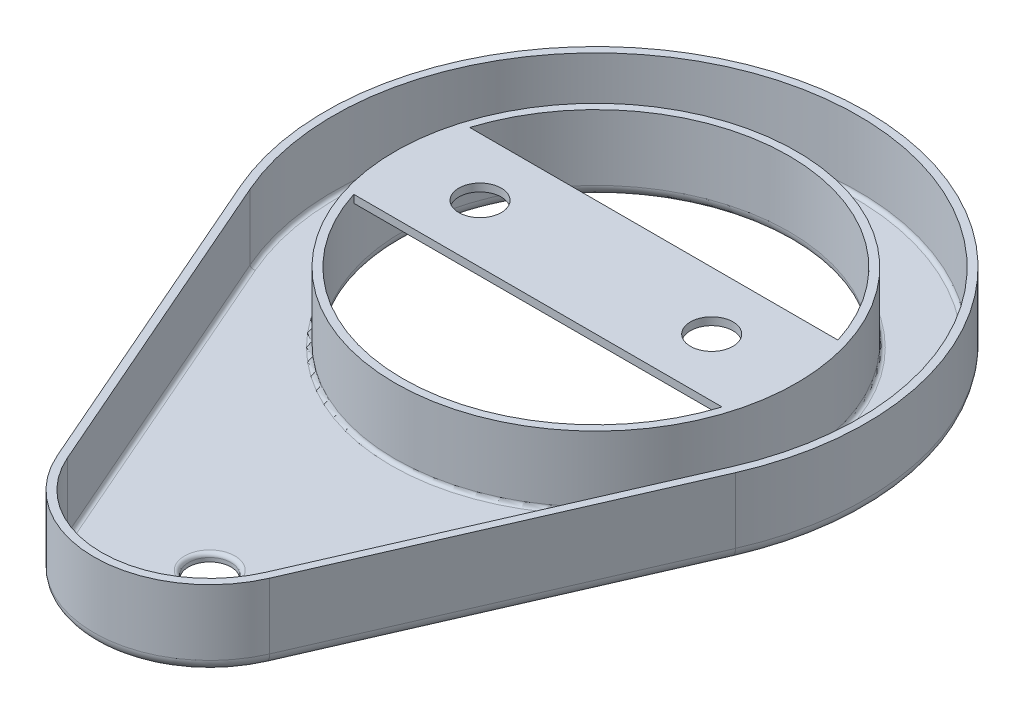
ISO-10303-21;
HEADER;
FILE_DESCRIPTION(('STEP AP214'),'2;1');
FILE_NAME('part.step','',(''),(''),'','','');
FILE_SCHEMA(('AUTOMOTIVE_DESIGN { 1 0 10303 214 1 1 1 1 }'));
ENDSEC;
DATA;
#1=APPLICATION_CONTEXT('core data for automotive mechanical design processes');
#2=APPLICATION_PROTOCOL_DEFINITION('international standard','automotive_design',2000,#1);
#3=PRODUCT_CONTEXT('',#1,'mechanical');
#4=PRODUCT('Part','Part','',(#3));
#5=PRODUCT_RELATED_PRODUCT_CATEGORY('part','',(#4));
#6=PRODUCT_DEFINITION_FORMATION('','',#4);
#7=PRODUCT_DEFINITION_CONTEXT('part definition',#1,'design');
#8=PRODUCT_DEFINITION('design','',#6,#7);
#9=PRODUCT_DEFINITION_SHAPE('','',#8);
#10=(LENGTH_UNIT() NAMED_UNIT(*) SI_UNIT(.MILLI.,.METRE.));
#11=(NAMED_UNIT(*) PLANE_ANGLE_UNIT() SI_UNIT($,.RADIAN.));
#12=(NAMED_UNIT(*) SI_UNIT($,.STERADIAN.) SOLID_ANGLE_UNIT());
#13=UNCERTAINTY_MEASURE_WITH_UNIT(LENGTH_MEASURE(1.E-05),#10,'distance_accuracy_value','');
#14=(GEOMETRIC_REPRESENTATION_CONTEXT(3) GLOBAL_UNCERTAINTY_ASSIGNED_CONTEXT((#13)) GLOBAL_UNIT_ASSIGNED_CONTEXT((#10,
#11,#12)) REPRESENTATION_CONTEXT('',''));
#15=CARTESIAN_POINT('',(0.,0.,0.));
#16=DIRECTION('',(0.,0.,1.));
#17=DIRECTION('',(1.,0.,0.));
#18=AXIS2_PLACEMENT_3D('',#15,#16,#17);
#19=CARTESIAN_POINT('',(0.,10.,0.));
#20=DIRECTION('',(0.,1.,0.));
#21=DIRECTION('',(0.,0.,1.));
#22=AXIS2_PLACEMENT_3D('',#19,#20,#21);
#23=PLANE('',#22);
#24=CARTESIAN_POINT('',(15.,10.,-50.));
#25=DIRECTION('',(0.,1.,0.));
#26=DIRECTION('',(0.,0.,1.));
#27=AXIS2_PLACEMENT_3D('',#24,#25,#26);
#28=CIRCLE('',#27,2.75);
#29=CARTESIAN_POINT('',(15.,10.,-47.25));
#30=VERTEX_POINT('',#29);
#31=EDGE_CURVE('E508',#30,#30,#28,.F.);
#32=ORIENTED_EDGE('',*,*,#31,.T.);
#33=EDGE_LOOP('',(#32));
#34=FACE_BOUND('',#33,.T.);
#35=CARTESIAN_POINT('',(-15.,10.,-50.));
#36=DIRECTION('',(0.,1.,0.));
#37=DIRECTION('',(0.,0.,1.));
#38=AXIS2_PLACEMENT_3D('',#35,#36,#37);
#39=CIRCLE('',#38,2.75);
#40=CARTESIAN_POINT('',(-15.,10.,-47.25));
#41=VERTEX_POINT('',#40);
#42=EDGE_CURVE('E517',#41,#41,#39,.F.);
#43=ORIENTED_EDGE('',*,*,#42,.T.);
#44=EDGE_LOOP('',(#43));
#45=FACE_BOUND('',#44,.T.);
#46=CARTESIAN_POINT('',(0.,10.,-50.));
#47=DIRECTION('',(0.,1.,0.));
#48=DIRECTION('',(0.,0.,1.));
#49=AXIS2_PLACEMENT_3D('',#46,#47,#48);
#50=CIRCLE('',#49,25.);
#51=CARTESIAN_POINT('',(23.8484800354236,10.,-57.5));
#52=VERTEX_POINT('',#51);
#53=CARTESIAN_POINT('',(-23.8484800354236,10.,-57.5));
#54=VERTEX_POINT('',#53);
#55=EDGE_CURVE('E156',#52,#54,#50,.T.);
#56=ORIENTED_EDGE('',*,*,#55,.F.);
#57=DIRECTION('',(-1.,0.,0.));
#58=VECTOR('',#57,1.);
#59=CARTESIAN_POINT('',(-23.8484800354236,10.,-57.5));
#60=LINE('',#59,#58);
#61=EDGE_CURVE('E172',#52,#54,#60,.T.);
#62=ORIENTED_EDGE('',*,*,#61,.T.);
#63=EDGE_LOOP('',(#56,#62));
#64=FACE_BOUND('',#63,.T.);
#65=DIRECTION('',(1.,0.,0.));
#66=VECTOR('',#65,1.);
#67=CARTESIAN_POINT('',(-23.8484800354236,10.,-42.5));
#68=LINE('',#67,#66);
#69=CARTESIAN_POINT('',(-23.8484800354236,10.,-42.5));
#70=VERTEX_POINT('',#69);
#71=CARTESIAN_POINT('',(23.8484800354236,10.,-42.5));
#72=VERTEX_POINT('',#71);
#73=EDGE_CURVE('E153',#70,#72,#68,.T.);
#74=ORIENTED_EDGE('',*,*,#73,.T.);
#75=EDGE_CURVE('E149',#70,#72,#50,.T.);
#76=ORIENTED_EDGE('',*,*,#75,.F.);
#77=EDGE_LOOP('',(#74,#76));
#78=FACE_BOUND('',#77,.T.);
#79=CARTESIAN_POINT('',(0.,10.,-50.));
#80=DIRECTION('',(0.,1.,0.));
#81=DIRECTION('',(0.,0.,1.));
#82=AXIS2_PLACEMENT_3D('',#79,#80,#81);
#83=CIRCLE('',#82,26.);
#84=CARTESIAN_POINT('',(0.,10.,-24.));
#85=VERTEX_POINT('',#84);
#86=EDGE_CURVE('E186',#85,#85,#83,.T.);
#87=ORIENTED_EDGE('',*,*,#86,.T.);
#88=EDGE_LOOP('',(#87));
#89=FACE_BOUND('',#88,.T.);
#90=ADVANCED_FACE('F34',(#34,#45,#64,#78,#89),#23,.T.);
#91=CARTESIAN_POINT('',(0.,10.,0.));
#92=DIRECTION('',(0.,1.,0.));
#93=DIRECTION('',(0.,0.,1.));
#94=AXIS2_PLACEMENT_3D('',#91,#92,#93);
#95=CIRCLE('',#94,14.);
#96=CARTESIAN_POINT('',(-12.8312119458764,10.,5.6));
#97=VERTEX_POINT('',#96);
#98=CARTESIAN_POINT('',(12.8312119458764,10.,5.6));
#99=VERTEX_POINT('',#98);
#100=EDGE_CURVE('E202',#97,#99,#95,.T.);
#101=ORIENTED_EDGE('',*,*,#100,.F.);
#102=DIRECTION('',(0.4,0.,0.916515138991168));
#103=VECTOR('',#102,1.);
#104=CARTESIAN_POINT('',(-12.8312119458764,10.,5.6));
#105=LINE('',#104,#103);
#106=CARTESIAN_POINT('',(-31.1615147256997,10.,-36.4));
#107=VERTEX_POINT('',#106);
#108=EDGE_CURVE('E197',#107,#97,#105,.T.);
#109=ORIENTED_EDGE('',*,*,#108,.F.);
#110=CARTESIAN_POINT('',(0.,10.,-50.));
#111=DIRECTION('',(0.,1.,0.));
#112=DIRECTION('',(0.,0.,1.));
#113=AXIS2_PLACEMENT_3D('',#110,#111,#112);
#114=CIRCLE('',#113,34.);
#115=CARTESIAN_POINT('',(31.1615147256997,10.,-36.4));
#116=VERTEX_POINT('',#115);
#117=EDGE_CURVE('E206',#116,#107,#114,.T.);
#118=ORIENTED_EDGE('',*,*,#117,.F.);
#119=DIRECTION('',(0.4,0.,-0.916515138991168));
#120=VECTOR('',#119,1.);
#121=CARTESIAN_POINT('',(12.8312119458764,10.,5.6));
#122=LINE('',#121,#120);
#123=EDGE_CURVE('E204',#99,#116,#122,.T.);
#124=ORIENTED_EDGE('',*,*,#123,.F.);
#125=EDGE_LOOP('',(#101,#109,#118,#124));
#126=FACE_BOUND('',#125,.T.);
#127=CARTESIAN_POINT('',(0.,10.,0.));
#128=DIRECTION('',(0.,1.,0.));
#129=DIRECTION('',(0.,0.,1.));
#130=AXIS2_PLACEMENT_3D('',#127,#128,#129);
#131=CIRCLE('',#130,15.);
#132=CARTESIAN_POINT('',(-13.7477270848675,10.,6.));
#133=VERTEX_POINT('',#132);
#134=CARTESIAN_POINT('',(13.7477270848675,10.,6.));
#135=VERTEX_POINT('',#134);
#136=EDGE_CURVE('E212',#133,#135,#131,.T.);
#137=ORIENTED_EDGE('',*,*,#136,.T.);
#138=DIRECTION('',(0.4,0.,-0.916515138991168));
#139=VECTOR('',#138,1.);
#140=CARTESIAN_POINT('',(13.7477270848675,10.,6.));
#141=LINE('',#140,#139);
#142=CARTESIAN_POINT('',(32.0780298646909,10.,-36.));
#143=VERTEX_POINT('',#142);
#144=EDGE_CURVE('E215',#135,#143,#141,.T.);
#145=ORIENTED_EDGE('',*,*,#144,.T.);
#146=CARTESIAN_POINT('',(0.,10.,-50.));
#147=DIRECTION('',(0.,1.,0.));
#148=DIRECTION('',(0.,0.,1.));
#149=AXIS2_PLACEMENT_3D('',#146,#147,#148);
#150=CIRCLE('',#149,35.);
#151=CARTESIAN_POINT('',(-32.0780298646909,10.,-36.));
#152=VERTEX_POINT('',#151);
#153=EDGE_CURVE('E217',#143,#152,#150,.T.);
#154=ORIENTED_EDGE('',*,*,#153,.T.);
#155=DIRECTION('',(0.4,0.,0.916515138991168));
#156=VECTOR('',#155,1.);
#157=CARTESIAN_POINT('',(-13.7477270848675,10.,6.));
#158=LINE('',#157,#156);
#159=EDGE_CURVE('E219',#152,#133,#158,.T.);
#160=ORIENTED_EDGE('',*,*,#159,.T.);
#161=EDGE_LOOP('',(#137,#145,#154,#160));
#162=FACE_BOUND('',#161,.T.);
#163=ADVANCED_FACE('F325',(#126,#162),#23,.T.);
#164=CARTESIAN_POINT('',(0.,0.,0.));
#165=DIRECTION('',(0.,1.,0.));
#166=DIRECTION('',(0.,0.,1.));
#167=AXIS2_PLACEMENT_3D('',#164,#165,#166);
#168=PLANE('',#167);
#169=CARTESIAN_POINT('',(0.,0.,-50.));
#170=DIRECTION('',(0.,1.,0.));
#171=DIRECTION('',(0.,0.,1.));
#172=AXIS2_PLACEMENT_3D('',#169,#170,#171);
#173=CIRCLE('',#172,26.5);
#174=CARTESIAN_POINT('',(0.,0.,-23.5));
#175=VERTEX_POINT('',#174);
#176=EDGE_CURVE('E281',#175,#175,#173,.T.);
#177=ORIENTED_EDGE('',*,*,#176,.T.);
#178=EDGE_LOOP('',(#177));
#179=FACE_BOUND('',#178,.T.);
#180=DIRECTION('',(0.4,0.,-0.916515138991168));
#181=VECTOR('',#180,1.);
#182=CARTESIAN_POINT('',(12.3729543763808,0.,5.4));
#183=LINE('',#182,#181);
#184=CARTESIAN_POINT('',(30.7032571562041,0.,-36.6));
#185=VERTEX_POINT('',#184);
#186=CARTESIAN_POINT('',(12.3729543763808,0.,5.4));
#187=VERTEX_POINT('',#186);
#188=EDGE_CURVE('E272',#185,#187,#183,.F.);
#189=ORIENTED_EDGE('',*,*,#188,.T.);
#190=CARTESIAN_POINT('',(0.,0.,0.));
#191=DIRECTION('',(0.,1.,0.));
#192=DIRECTION('',(0.,0.,1.));
#193=AXIS2_PLACEMENT_3D('',#190,#191,#192);
#194=CIRCLE('',#193,13.5);
#195=CARTESIAN_POINT('',(-12.3729543763808,0.,5.4));
#196=VERTEX_POINT('',#195);
#197=EDGE_CURVE('E278',#187,#196,#194,.F.);
#198=ORIENTED_EDGE('',*,*,#197,.T.);
#199=DIRECTION('',(0.4,0.,0.916515138991168));
#200=VECTOR('',#199,1.);
#201=CARTESIAN_POINT('',(-12.3729543763808,0.,5.4));
#202=LINE('',#201,#200);
#203=CARTESIAN_POINT('',(-30.7032571562041,0.,-36.6));
#204=VERTEX_POINT('',#203);
#205=EDGE_CURVE('E276',#196,#204,#202,.F.);
#206=ORIENTED_EDGE('',*,*,#205,.T.);
#207=CARTESIAN_POINT('',(0.,0.,-50.));
#208=DIRECTION('',(0.,1.,0.));
#209=DIRECTION('',(0.,0.,1.));
#210=AXIS2_PLACEMENT_3D('',#207,#208,#209);
#211=CIRCLE('',#210,33.5);
#212=EDGE_CURVE('E274',#204,#185,#211,.F.);
#213=ORIENTED_EDGE('',*,*,#212,.T.);
#214=EDGE_LOOP('',(#189,#198,#206,#213));
#215=FACE_BOUND('',#214,.T.);
#216=CARTESIAN_POINT('',(0.,0.,0.));
#217=DIRECTION('',(0.,1.,0.));
#218=DIRECTION('',(0.,0.,1.));
#219=AXIS2_PLACEMENT_3D('',#216,#217,#218);
#220=CIRCLE('',#219,2.75);
#221=CARTESIAN_POINT('',(0.,0.,2.75));
#222=VERTEX_POINT('',#221);
#223=EDGE_CURVE('E173',#222,#222,#220,.F.);
#224=ORIENTED_EDGE('',*,*,#223,.F.);
#225=EDGE_LOOP('',(#224));
#226=FACE_BOUND('',#225,.T.);
#227=ADVANCED_FACE('F309',(#179,#215,#226),#168,.F.);
#228=CARTESIAN_POINT('',(0.,10.,0.));
#229=DIRECTION('',(0.,-1.,0.));
#230=DIRECTION('',(0.,0.,-1.));
#231=AXIS2_PLACEMENT_3D('',#228,#229,#230);
#232=CYLINDRICAL_SURFACE('',#231,15.);
#233=DIRECTION('',(0.,-1.,0.));
#234=VECTOR('',#233,1.);
#235=CARTESIAN_POINT('',(-13.7477270848675,10.,6.));
#236=LINE('',#235,#234);
#237=CARTESIAN_POINT('',(-13.7477270848675,1.5,6.));
#238=VERTEX_POINT('',#237);
#239=EDGE_CURVE('E221',#133,#238,#236,.T.);
#240=ORIENTED_EDGE('',*,*,#239,.T.);
#241=CARTESIAN_POINT('',(0.,1.5,0.));
#242=DIRECTION('',(0.,1.,0.));
#243=DIRECTION('',(0.,0.,1.));
#244=AXIS2_PLACEMENT_3D('',#241,#242,#243);
#245=CIRCLE('',#244,15.);
#246=CARTESIAN_POINT('',(13.7477270848675,1.5,6.));
#247=VERTEX_POINT('',#246);
#248=EDGE_CURVE('E260',#238,#247,#245,.T.);
#249=ORIENTED_EDGE('',*,*,#248,.T.);
#250=DIRECTION('',(0.,-1.,0.));
#251=VECTOR('',#250,1.);
#252=CARTESIAN_POINT('',(13.7477270848675,10.,6.));
#253=LINE('',#252,#251);
#254=EDGE_CURVE('E228',#135,#247,#253,.T.);
#255=ORIENTED_EDGE('',*,*,#254,.F.);
#256=ORIENTED_EDGE('',*,*,#136,.F.);
#257=EDGE_LOOP('',(#240,#249,#255,#256));
#258=FACE_BOUND('',#257,.T.);
#259=ADVANCED_FACE('F319',(#258),#232,.T.);
#260=CARTESIAN_POINT('',(13.7477270848675,10.,6.));
#261=DIRECTION('',(-0.916515138991168,0.,-0.4));
#262=DIRECTION('',(-0.4,0.,0.916515138991168));
#263=AXIS2_PLACEMENT_3D('',#260,#261,#262);
#264=PLANE('',#263);
#265=ORIENTED_EDGE('',*,*,#254,.T.);
#266=DIRECTION('',(0.4,0.,-0.916515138991168));
#267=VECTOR('',#266,1.);
#268=CARTESIAN_POINT('',(13.7477270848675,1.5,6.));
#269=LINE('',#268,#267);
#270=CARTESIAN_POINT('',(32.0780298646909,1.5,-36.));
#271=VERTEX_POINT('',#270);
#272=EDGE_CURVE('E11',#247,#271,#269,.T.);
#273=ORIENTED_EDGE('',*,*,#272,.T.);
#274=DIRECTION('',(0.,-1.,0.));
#275=VECTOR('',#274,1.);
#276=CARTESIAN_POINT('',(32.0780298646909,10.,-36.));
#277=LINE('',#276,#275);
#278=EDGE_CURVE('E226',#143,#271,#277,.T.);
#279=ORIENTED_EDGE('',*,*,#278,.F.);
#280=ORIENTED_EDGE('',*,*,#144,.F.);
#281=EDGE_LOOP('',(#265,#273,#279,#280));
#282=FACE_BOUND('',#281,.T.);
#283=ADVANCED_FACE('F322',(#282),#264,.F.);
#284=CARTESIAN_POINT('',(0.,10.,-50.));
#285=DIRECTION('',(0.,-1.,0.));
#286=DIRECTION('',(0.,0.,-1.));
#287=AXIS2_PLACEMENT_3D('',#284,#285,#286);
#288=CYLINDRICAL_SURFACE('',#287,35.);
#289=ORIENTED_EDGE('',*,*,#278,.T.);
#290=CARTESIAN_POINT('',(0.,1.5,-50.));
#291=DIRECTION('',(0.,1.,0.));
#292=DIRECTION('',(0.,0.,1.));
#293=AXIS2_PLACEMENT_3D('',#290,#291,#292);
#294=CIRCLE('',#293,35.);
#295=CARTESIAN_POINT('',(-32.0780298646909,1.5,-36.));
#296=VERTEX_POINT('',#295);
#297=EDGE_CURVE('E56',#271,#296,#294,.T.);
#298=ORIENTED_EDGE('',*,*,#297,.T.);
#299=DIRECTION('',(0.,-1.,0.));
#300=VECTOR('',#299,1.);
#301=CARTESIAN_POINT('',(-32.0780298646909,10.,-36.));
#302=LINE('',#301,#300);
#303=EDGE_CURVE('E224',#152,#296,#302,.T.);
#304=ORIENTED_EDGE('',*,*,#303,.F.);
#305=ORIENTED_EDGE('',*,*,#153,.F.);
#306=EDGE_LOOP('',(#289,#298,#304,#305));
#307=FACE_BOUND('',#306,.T.);
#308=ADVANCED_FACE('F329',(#307),#288,.T.);
#309=CARTESIAN_POINT('',(-13.7477270848675,10.,6.));
#310=DIRECTION('',(0.916515138991168,0.,-0.4));
#311=DIRECTION('',(-0.4,0.,-0.916515138991168));
#312=AXIS2_PLACEMENT_3D('',#309,#310,#311);
#313=PLANE('',#312);
#314=ORIENTED_EDGE('',*,*,#303,.T.);
#315=DIRECTION('',(0.4,0.,0.916515138991168));
#316=VECTOR('',#315,1.);
#317=CARTESIAN_POINT('',(-13.7477270848675,1.5,6.));
#318=LINE('',#317,#316);
#319=EDGE_CURVE('E284',#296,#238,#318,.T.);
#320=ORIENTED_EDGE('',*,*,#319,.T.);
#321=ORIENTED_EDGE('',*,*,#239,.F.);
#322=ORIENTED_EDGE('',*,*,#159,.F.);
#323=EDGE_LOOP('',(#314,#320,#321,#322));
#324=FACE_BOUND('',#323,.T.);
#325=ADVANCED_FACE('F328',(#324),#313,.F.);
#326=CARTESIAN_POINT('',(0.,10.,-50.));
#327=DIRECTION('',(0.,-1.,0.));
#328=DIRECTION('',(0.,0.,-1.));
#329=AXIS2_PLACEMENT_3D('',#326,#327,#328);
#330=CYLINDRICAL_SURFACE('',#329,25.);
#331=CARTESIAN_POINT('',(0.,1.5,-50.));
#332=DIRECTION('',(0.,1.,0.));
#333=DIRECTION('',(0.,0.,1.));
#334=AXIS2_PLACEMENT_3D('',#331,#332,#333);
#335=CIRCLE('',#334,25.);
#336=CARTESIAN_POINT('',(0.,1.5,-25.));
#337=VERTEX_POINT('',#336);
#338=EDGE_CURVE('E43',#337,#337,#335,.F.);
#339=ORIENTED_EDGE('',*,*,#338,.T.);
#340=EDGE_LOOP('',(#339));
#341=FACE_BOUND('',#340,.T.);
#342=DIRECTION('',(0.,1.,0.));
#343=VECTOR('',#342,1.);
#344=CARTESIAN_POINT('',(23.8484800354236,9.,-57.5));
#345=LINE('',#344,#343);
#346=CARTESIAN_POINT('',(23.8484800354236,9.,-57.5));
#347=VERTEX_POINT('',#346);
#348=EDGE_CURVE('E187',#347,#52,#345,.T.);
#349=ORIENTED_EDGE('',*,*,#348,.T.);
#350=ORIENTED_EDGE('',*,*,#55,.T.);
#351=DIRECTION('',(0.,1.,0.));
#352=VECTOR('',#351,1.);
#353=CARTESIAN_POINT('',(-23.8484800354236,9.,-57.5));
#354=LINE('',#353,#352);
#355=CARTESIAN_POINT('',(-23.8484800354236,9.,-57.5));
#356=VERTEX_POINT('',#355);
#357=EDGE_CURVE('E183',#356,#54,#354,.T.);
#358=ORIENTED_EDGE('',*,*,#357,.F.);
#359=CARTESIAN_POINT('',(0.,9.,-50.));
#360=DIRECTION('',(0.,1.,0.));
#361=DIRECTION('',(0.,0.,1.));
#362=AXIS2_PLACEMENT_3D('',#359,#360,#361);
#363=CIRCLE('',#362,25.);
#364=CARTESIAN_POINT('',(-23.8484800354236,9.,-42.5));
#365=VERTEX_POINT('',#364);
#366=EDGE_CURVE('E164',#356,#365,#363,.T.);
#367=ORIENTED_EDGE('',*,*,#366,.T.);
#368=DIRECTION('',(0.,1.,0.));
#369=VECTOR('',#368,1.);
#370=CARTESIAN_POINT('',(-23.8484800354236,9.,-42.5));
#371=LINE('',#370,#369);
#372=EDGE_CURVE('E160',#365,#70,#371,.T.);
#373=ORIENTED_EDGE('',*,*,#372,.T.);
#374=ORIENTED_EDGE('',*,*,#75,.T.);
#375=DIRECTION('',(0.,1.,0.));
#376=VECTOR('',#375,1.);
#377=CARTESIAN_POINT('',(23.8484800354236,9.,-42.5));
#378=LINE('',#377,#376);
#379=CARTESIAN_POINT('',(23.8484800354236,9.,-42.5));
#380=VERTEX_POINT('',#379);
#381=EDGE_CURVE('E168',#380,#72,#378,.T.);
#382=ORIENTED_EDGE('',*,*,#381,.F.);
#383=CARTESIAN_POINT('',(0.,9.,-50.));
#384=DIRECTION('',(0.,1.,0.));
#385=DIRECTION('',(0.,0.,1.));
#386=AXIS2_PLACEMENT_3D('',#383,#384,#385);
#387=CIRCLE('',#386,25.);
#388=EDGE_CURVE('E522',#380,#347,#387,.T.);
#389=ORIENTED_EDGE('',*,*,#388,.T.);
#390=EDGE_LOOP('',(#349,#350,#358,#367,#373,#374,#382,#389));
#391=FACE_BOUND('',#390,.T.);
#392=ADVANCED_FACE('F162',(#341,#391),#330,.F.);
#393=CARTESIAN_POINT('',(0.,1.,0.));
#394=DIRECTION('',(0.,1.,0.));
#395=DIRECTION('',(0.,0.,1.));
#396=AXIS2_PLACEMENT_3D('',#393,#394,#395);
#397=PLANE('',#396);
#398=CARTESIAN_POINT('',(0.,1.,-50.));
#399=DIRECTION('',(0.,1.,0.));
#400=DIRECTION('',(0.,0.,1.));
#401=AXIS2_PLACEMENT_3D('',#398,#399,#400);
#402=CIRCLE('',#401,26.5);
#403=CARTESIAN_POINT('',(0.,1.,-23.5));
#404=VERTEX_POINT('',#403);
#405=EDGE_CURVE('E245',#404,#404,#402,.F.);
#406=ORIENTED_EDGE('',*,*,#405,.T.);
#407=EDGE_LOOP('',(#406));
#408=FACE_BOUND('',#407,.T.);
#409=CARTESIAN_POINT('',(0.,1.,-50.));
#410=DIRECTION('',(0.,1.,0.));
#411=DIRECTION('',(0.,0.,1.));
#412=AXIS2_PLACEMENT_3D('',#409,#410,#411);
#413=CIRCLE('',#412,33.5);
#414=CARTESIAN_POINT('',(30.7032571562041,1.,-36.6));
#415=VERTEX_POINT('',#414);
#416=CARTESIAN_POINT('',(-30.7032571562041,1.,-36.6));
#417=VERTEX_POINT('',#416);
#418=EDGE_CURVE('E240',#415,#417,#413,.T.);
#419=ORIENTED_EDGE('',*,*,#418,.T.);
#420=DIRECTION('',(0.4,0.,0.916515138991168));
#421=VECTOR('',#420,1.);
#422=CARTESIAN_POINT('',(-12.3729543763808,1.,5.40000000000001));
#423=LINE('',#422,#421);
#424=CARTESIAN_POINT('',(-12.3729543763808,1.,5.40000000000001));
#425=VERTEX_POINT('',#424);
#426=EDGE_CURVE('E242',#417,#425,#423,.T.);
#427=ORIENTED_EDGE('',*,*,#426,.T.);
#428=CARTESIAN_POINT('',(0.,1.,0.));
#429=DIRECTION('',(0.,1.,0.));
#430=DIRECTION('',(0.,0.,1.));
#431=AXIS2_PLACEMENT_3D('',#428,#429,#430);
#432=CIRCLE('',#431,13.5);
#433=CARTESIAN_POINT('',(12.3729543763808,1.,5.4));
#434=VERTEX_POINT('',#433);
#435=EDGE_CURVE('E236',#425,#434,#432,.T.);
#436=ORIENTED_EDGE('',*,*,#435,.T.);
#437=DIRECTION('',(0.4,0.,-0.916515138991168));
#438=VECTOR('',#437,1.);
#439=CARTESIAN_POINT('',(30.7032571562041,1.,-36.6));
#440=LINE('',#439,#438);
#441=EDGE_CURVE('E238',#434,#415,#440,.T.);
#442=ORIENTED_EDGE('',*,*,#441,.T.);
#443=EDGE_LOOP('',(#419,#427,#436,#442));
#444=FACE_BOUND('',#443,.T.);
#445=CARTESIAN_POINT('',(0.,1.,0.));
#446=DIRECTION('',(0.,1.,0.));
#447=DIRECTION('',(0.,0.,1.));
#448=AXIS2_PLACEMENT_3D('',#445,#446,#447);
#449=CIRCLE('',#448,3.25);
#450=CARTESIAN_POINT('',(0.,1.,3.25));
#451=VERTEX_POINT('',#450);
#452=EDGE_CURVE('E233',#451,#451,#449,.F.);
#453=ORIENTED_EDGE('',*,*,#452,.T.);
#454=EDGE_LOOP('',(#453));
#455=FACE_BOUND('',#454,.T.);
#456=ADVANCED_FACE('F372',(#408,#444,#455),#397,.T.);
#457=CARTESIAN_POINT('',(0.,10.,0.));
#458=DIRECTION('',(0.,-1.,0.));
#459=DIRECTION('',(0.,0.,-1.));
#460=AXIS2_PLACEMENT_3D('',#457,#458,#459);
#461=CYLINDRICAL_SURFACE('',#460,14.);
#462=DIRECTION('',(0.,1.,0.));
#463=VECTOR('',#462,1.);
#464=CARTESIAN_POINT('',(12.8312119458764,10.,5.6));
#465=LINE('',#464,#463);
#466=CARTESIAN_POINT('',(12.8312119458764,1.5,5.6));
#467=VERTEX_POINT('',#466);
#468=EDGE_CURVE('E157',#99,#467,#465,.F.);
#469=ORIENTED_EDGE('',*,*,#468,.T.);
#470=CARTESIAN_POINT('',(0.,1.5,0.));
#471=DIRECTION('',(0.,1.,0.));
#472=DIRECTION('',(0.,0.,1.));
#473=AXIS2_PLACEMENT_3D('',#470,#471,#472);
#474=CIRCLE('',#473,14.);
#475=CARTESIAN_POINT('',(-12.8312119458763,1.5,5.60000000000001));
#476=VERTEX_POINT('',#475);
#477=EDGE_CURVE('E255',#467,#476,#474,.F.);
#478=ORIENTED_EDGE('',*,*,#477,.T.);
#479=DIRECTION('',(0.,-1.,0.));
#480=VECTOR('',#479,1.);
#481=CARTESIAN_POINT('',(-12.8312119458763,10.,5.60000000000001));
#482=LINE('',#481,#480);
#483=EDGE_CURVE('E193',#97,#476,#482,.T.);
#484=ORIENTED_EDGE('',*,*,#483,.F.);
#485=ORIENTED_EDGE('',*,*,#100,.T.);
#486=EDGE_LOOP('',(#469,#478,#484,#485));
#487=FACE_BOUND('',#486,.T.);
#488=ADVANCED_FACE('F376',(#487),#461,.F.);
#489=CARTESIAN_POINT('',(12.8312119458764,10.,5.6));
#490=DIRECTION('',(-0.916515138991168,0.,-0.4));
#491=DIRECTION('',(-0.4,0.,0.916515138991168));
#492=AXIS2_PLACEMENT_3D('',#489,#490,#491);
#493=PLANE('',#492);
#494=DIRECTION('',(0.,-1.,0.));
#495=VECTOR('',#494,1.);
#496=CARTESIAN_POINT('',(31.1615147256997,10.,-36.4));
#497=LINE('',#496,#495);
#498=CARTESIAN_POINT('',(31.1615147256997,1.5,-36.4));
#499=VERTEX_POINT('',#498);
#500=EDGE_CURVE('E192',#116,#499,#497,.T.);
#501=ORIENTED_EDGE('',*,*,#500,.T.);
#502=DIRECTION('',(0.4,0.,-0.916515138991168));
#503=VECTOR('',#502,1.);
#504=CARTESIAN_POINT('',(12.8312119458764,1.5,5.6));
#505=LINE('',#504,#503);
#506=EDGE_CURVE('E253',#499,#467,#505,.F.);
#507=ORIENTED_EDGE('',*,*,#506,.T.);
#508=ORIENTED_EDGE('',*,*,#468,.F.);
#509=ORIENTED_EDGE('',*,*,#123,.T.);
#510=EDGE_LOOP('',(#501,#507,#508,#509));
#511=FACE_BOUND('',#510,.T.);
#512=ADVANCED_FACE('F382',(#511),#493,.T.);
#513=CARTESIAN_POINT('',(0.,10.,-50.));
#514=DIRECTION('',(0.,-1.,0.));
#515=DIRECTION('',(0.,0.,-1.));
#516=AXIS2_PLACEMENT_3D('',#513,#514,#515);
#517=CYLINDRICAL_SURFACE('',#516,34.);
#518=DIRECTION('',(0.,1.,0.));
#519=VECTOR('',#518,1.);
#520=CARTESIAN_POINT('',(-31.1615147256997,10.,-36.4));
#521=LINE('',#520,#519);
#522=CARTESIAN_POINT('',(-31.1615147256997,1.5,-36.4));
#523=VERTEX_POINT('',#522);
#524=EDGE_CURVE('E196',#107,#523,#521,.F.);
#525=ORIENTED_EDGE('',*,*,#524,.T.);
#526=CARTESIAN_POINT('',(0.,1.5,-50.));
#527=DIRECTION('',(0.,1.,0.));
#528=DIRECTION('',(0.,0.,1.));
#529=AXIS2_PLACEMENT_3D('',#526,#527,#528);
#530=CIRCLE('',#529,34.);
#531=EDGE_CURVE('E251',#523,#499,#530,.F.);
#532=ORIENTED_EDGE('',*,*,#531,.T.);
#533=ORIENTED_EDGE('',*,*,#500,.F.);
#534=ORIENTED_EDGE('',*,*,#117,.T.);
#535=EDGE_LOOP('',(#525,#532,#533,#534));
#536=FACE_BOUND('',#535,.T.);
#537=ADVANCED_FACE('F391',(#536),#517,.F.);
#538=CARTESIAN_POINT('',(-12.8312119458764,10.,5.6));
#539=DIRECTION('',(0.916515138991168,0.,-0.4));
#540=DIRECTION('',(-0.4,0.,-0.916515138991168));
#541=AXIS2_PLACEMENT_3D('',#538,#539,#540);
#542=PLANE('',#541);
#543=ORIENTED_EDGE('',*,*,#483,.T.);
#544=DIRECTION('',(0.4,0.,0.916515138991168));
#545=VECTOR('',#544,1.);
#546=CARTESIAN_POINT('',(-31.1615147256997,1.5,-36.4));
#547=LINE('',#546,#545);
#548=EDGE_CURVE('E248',#476,#523,#547,.F.);
#549=ORIENTED_EDGE('',*,*,#548,.T.);
#550=ORIENTED_EDGE('',*,*,#524,.F.);
#551=ORIENTED_EDGE('',*,*,#108,.T.);
#552=EDGE_LOOP('',(#543,#549,#550,#551));
#553=FACE_BOUND('',#552,.T.);
#554=ADVANCED_FACE('F395',(#553),#542,.T.);
#555=CARTESIAN_POINT('',(0.,10.,-50.));
#556=DIRECTION('',(0.,-1.,0.));
#557=DIRECTION('',(0.,0.,-1.));
#558=AXIS2_PLACEMENT_3D('',#555,#556,#557);
#559=CYLINDRICAL_SURFACE('',#558,26.);
#560=CARTESIAN_POINT('',(0.,1.5,-50.));
#561=DIRECTION('',(0.,1.,0.));
#562=DIRECTION('',(0.,0.,1.));
#563=AXIS2_PLACEMENT_3D('',#560,#561,#562);
#564=CIRCLE('',#563,26.);
#565=CARTESIAN_POINT('',(0.,1.5,-24.));
#566=VERTEX_POINT('',#565);
#567=EDGE_CURVE('E230',#566,#566,#564,.T.);
#568=ORIENTED_EDGE('',*,*,#567,.T.);
#569=EDGE_LOOP('',(#568));
#570=FACE_BOUND('',#569,.T.);
#571=ORIENTED_EDGE('',*,*,#86,.F.);
#572=EDGE_LOOP('',(#571));
#573=FACE_BOUND('',#572,.T.);
#574=ADVANCED_FACE('F398',(#570,#573),#559,.T.);
#575=CARTESIAN_POINT('',(-23.8484800354236,9.,-57.5));
#576=DIRECTION('',(0.,0.,-1.));
#577=DIRECTION('',(-1.,0.,0.));
#578=AXIS2_PLACEMENT_3D('',#575,#576,#577);
#579=PLANE('',#578);
#580=ORIENTED_EDGE('',*,*,#61,.F.);
#581=ORIENTED_EDGE('',*,*,#348,.F.);
#582=DIRECTION('',(-1.,0.,0.));
#583=VECTOR('',#582,1.);
#584=CARTESIAN_POINT('',(-23.8484800354236,9.,-57.5));
#585=LINE('',#584,#583);
#586=EDGE_CURVE('E169',#347,#356,#585,.T.);
#587=ORIENTED_EDGE('',*,*,#586,.T.);
#588=ORIENTED_EDGE('',*,*,#357,.T.);
#589=EDGE_LOOP('',(#580,#581,#587,#588));
#590=FACE_BOUND('',#589,.T.);
#591=ADVANCED_FACE('F401',(#590),#579,.T.);
#592=CARTESIAN_POINT('',(-23.8484800354236,9.,-42.5));
#593=DIRECTION('',(0.,0.,1.));
#594=DIRECTION('',(1.,0.,0.));
#595=AXIS2_PLACEMENT_3D('',#592,#593,#594);
#596=PLANE('',#595);
#597=ORIENTED_EDGE('',*,*,#73,.F.);
#598=ORIENTED_EDGE('',*,*,#372,.F.);
#599=DIRECTION('',(1.,0.,0.));
#600=VECTOR('',#599,1.);
#601=CARTESIAN_POINT('',(-23.8484800354236,9.,-42.5));
#602=LINE('',#601,#600);
#603=EDGE_CURVE('E521',#365,#380,#602,.T.);
#604=ORIENTED_EDGE('',*,*,#603,.T.);
#605=ORIENTED_EDGE('',*,*,#381,.T.);
#606=EDGE_LOOP('',(#597,#598,#604,#605));
#607=FACE_BOUND('',#606,.T.);
#608=ADVANCED_FACE('F171',(#607),#596,.T.);
#609=CARTESIAN_POINT('',(0.,9.,-50.));
#610=DIRECTION('',(0.,1.,0.));
#611=DIRECTION('',(0.,0.,1.));
#612=AXIS2_PLACEMENT_3D('',#609,#610,#611);
#613=PLANE('',#612);
#614=CARTESIAN_POINT('',(15.,9.,-50.));
#615=DIRECTION('',(0.,-1.,0.));
#616=DIRECTION('',(0.,0.,-1.));
#617=AXIS2_PLACEMENT_3D('',#614,#615,#616);
#618=CIRCLE('',#617,2.75);
#619=CARTESIAN_POINT('',(15.,9.,-52.75));
#620=VERTEX_POINT('',#619);
#621=EDGE_CURVE('E292',#620,#620,#618,.T.);
#622=ORIENTED_EDGE('',*,*,#621,.F.);
#623=EDGE_LOOP('',(#622));
#624=FACE_BOUND('',#623,.T.);
#625=CARTESIAN_POINT('',(-15.,9.,-50.));
#626=DIRECTION('',(0.,-1.,0.));
#627=DIRECTION('',(0.,0.,1.));
#628=AXIS2_PLACEMENT_3D('',#625,#626,#627);
#629=CIRCLE('',#628,2.75);
#630=CARTESIAN_POINT('',(-15.,9.,-47.25));
#631=VERTEX_POINT('',#630);
#632=EDGE_CURVE('E512',#631,#631,#629,.T.);
#633=ORIENTED_EDGE('',*,*,#632,.F.);
#634=EDGE_LOOP('',(#633));
#635=FACE_BOUND('',#634,.T.);
#636=ORIENTED_EDGE('',*,*,#366,.F.);
#637=ORIENTED_EDGE('',*,*,#586,.F.);
#638=ORIENTED_EDGE('',*,*,#388,.F.);
#639=ORIENTED_EDGE('',*,*,#603,.F.);
#640=EDGE_LOOP('',(#636,#637,#638,#639));
#641=FACE_BOUND('',#640,.T.);
#642=ADVANCED_FACE('F424',(#624,#635,#641),#613,.F.);
#643=CARTESIAN_POINT('',(0.,-0.000999999999999916,0.));
#644=DIRECTION('',(0.,1.,0.));
#645=DIRECTION('',(0.,0.,1.));
#646=AXIS2_PLACEMENT_3D('',#643,#644,#645);
#647=CYLINDRICAL_SURFACE('',#646,2.75);
#648=CARTESIAN_POINT('',(0.,0.5,0.));
#649=DIRECTION('',(0.,1.,0.));
#650=DIRECTION('',(0.,0.,1.));
#651=AXIS2_PLACEMENT_3D('',#648,#649,#650);
#652=CIRCLE('',#651,2.75);
#653=CARTESIAN_POINT('',(0.,0.5,2.75));
#654=VERTEX_POINT('',#653);
#655=EDGE_CURVE('E257',#654,#654,#652,.T.);
#656=ORIENTED_EDGE('',*,*,#655,.T.);
#657=EDGE_LOOP('',(#656));
#658=FACE_BOUND('',#657,.T.);
#659=ORIENTED_EDGE('',*,*,#223,.T.);
#660=EDGE_LOOP('',(#659));
#661=FACE_BOUND('',#660,.T.);
#662=ADVANCED_FACE('F414',(#658,#661),#647,.F.);
#663=CARTESIAN_POINT('',(0.,1.5,-50.));
#664=DIRECTION('',(0.,1.,0.));
#665=DIRECTION('',(0.,0.,1.));
#666=AXIS2_PLACEMENT_3D('',#663,#664,#665);
#667=TOROIDAL_SURFACE('',#666,26.5,0.5);
#668=ORIENTED_EDGE('',*,*,#405,.F.);
#669=EDGE_LOOP('',(#668));
#670=FACE_BOUND('',#669,.T.);
#671=ORIENTED_EDGE('',*,*,#567,.F.);
#672=EDGE_LOOP('',(#671));
#673=FACE_BOUND('',#672,.T.);
#674=ADVANCED_FACE('F411',(#670,#673),#667,.F.);
#675=CARTESIAN_POINT('',(12.3729543763808,1.5,5.4));
#676=DIRECTION('',(-0.4,0.,0.916515138991168));
#677=DIRECTION('',(0.916515138991168,0.,0.4));
#678=AXIS2_PLACEMENT_3D('',#675,#676,#677);
#679=CYLINDRICAL_SURFACE('',#678,0.5);
#680=CARTESIAN_POINT('',(12.3729543763808,1.5,5.4));
#681=DIRECTION('',(0.399999999999999,0.,-0.916515138991168));
#682=DIRECTION('',(-0.916515138991168,0.,-0.399999999999999));
#683=AXIS2_PLACEMENT_3D('',#680,#681,#682);
#684=CIRCLE('',#683,0.5);
#685=EDGE_CURVE('E265',#467,#434,#684,.T.);
#686=ORIENTED_EDGE('',*,*,#685,.F.);
#687=ORIENTED_EDGE('',*,*,#506,.F.);
#688=CARTESIAN_POINT('',(30.7032571562041,1.5,-36.6));
#689=DIRECTION('',(-0.399999999999994,0.,0.916515138991171));
#690=DIRECTION('',(0.916515138991171,0.,0.399999999999994));
#691=AXIS2_PLACEMENT_3D('',#688,#689,#690);
#692=CIRCLE('',#691,0.5);
#693=EDGE_CURVE('E178',#415,#499,#692,.T.);
#694=ORIENTED_EDGE('',*,*,#693,.F.);
#695=ORIENTED_EDGE('',*,*,#441,.F.);
#696=EDGE_LOOP('',(#686,#687,#694,#695));
#697=FACE_BOUND('',#696,.T.);
#698=ADVANCED_FACE('F413',(#697),#679,.F.);
#699=CARTESIAN_POINT('',(0.,1.5,-50.));
#700=DIRECTION('',(0.,1.,0.));
#701=DIRECTION('',(0.,0.,1.));
#702=AXIS2_PLACEMENT_3D('',#699,#700,#701);
#703=TOROIDAL_SURFACE('',#702,33.5,0.5);
#704=ORIENTED_EDGE('',*,*,#693,.T.);
#705=ORIENTED_EDGE('',*,*,#531,.F.);
#706=CARTESIAN_POINT('',(-30.7032571562041,1.5,-36.6));
#707=DIRECTION('',(-0.399999999999996,0.,-0.91651513899117));
#708=DIRECTION('',(-0.91651513899117,0.,0.399999999999996));
#709=AXIS2_PLACEMENT_3D('',#706,#707,#708);
#710=CIRCLE('',#709,0.5);
#711=EDGE_CURVE('E263',#417,#523,#710,.T.);
#712=ORIENTED_EDGE('',*,*,#711,.F.);
#713=ORIENTED_EDGE('',*,*,#418,.F.);
#714=EDGE_LOOP('',(#704,#705,#712,#713));
#715=FACE_BOUND('',#714,.T.);
#716=ADVANCED_FACE('F421',(#715),#703,.F.);
#717=CARTESIAN_POINT('',(0.,1.5,0.));
#718=DIRECTION('',(0.,1.,0.));
#719=DIRECTION('',(0.,0.,1.));
#720=AXIS2_PLACEMENT_3D('',#717,#718,#719);
#721=TOROIDAL_SURFACE('',#720,13.5,0.5);
#722=ORIENTED_EDGE('',*,*,#685,.T.);
#723=ORIENTED_EDGE('',*,*,#435,.F.);
#724=CARTESIAN_POINT('',(-12.3729543763808,1.5,5.40000000000001));
#725=DIRECTION('',(0.4,0.,0.916515138991168));
#726=DIRECTION('',(0.916515138991168,0.,-0.400000000000001));
#727=AXIS2_PLACEMENT_3D('',#724,#725,#726);
#728=CIRCLE('',#727,0.5);
#729=EDGE_CURVE('E261',#476,#425,#728,.T.);
#730=ORIENTED_EDGE('',*,*,#729,.F.);
#731=ORIENTED_EDGE('',*,*,#477,.F.);
#732=EDGE_LOOP('',(#722,#723,#730,#731));
#733=FACE_BOUND('',#732,.T.);
#734=ADVANCED_FACE('F433',(#733),#721,.F.);
#735=CARTESIAN_POINT('',(-12.3729543763808,1.5,5.4));
#736=DIRECTION('',(-0.4,0.,-0.916515138991168));
#737=DIRECTION('',(-0.916515138991168,0.,0.4));
#738=AXIS2_PLACEMENT_3D('',#735,#736,#737);
#739=CYLINDRICAL_SURFACE('',#738,0.5);
#740=ORIENTED_EDGE('',*,*,#711,.T.);
#741=ORIENTED_EDGE('',*,*,#548,.F.);
#742=ORIENTED_EDGE('',*,*,#729,.T.);
#743=ORIENTED_EDGE('',*,*,#426,.F.);
#744=EDGE_LOOP('',(#740,#741,#742,#743));
#745=FACE_BOUND('',#744,.T.);
#746=ADVANCED_FACE('F429',(#745),#739,.F.);
#747=CARTESIAN_POINT('',(0.,0.5,0.));
#748=DIRECTION('',(0.,1.,0.));
#749=DIRECTION('',(0.,0.,1.));
#750=AXIS2_PLACEMENT_3D('',#747,#748,#749);
#751=TOROIDAL_SURFACE('',#750,3.25,0.5);
#752=ORIENTED_EDGE('',*,*,#452,.F.);
#753=EDGE_LOOP('',(#752));
#754=FACE_BOUND('',#753,.T.);
#755=ORIENTED_EDGE('',*,*,#655,.F.);
#756=EDGE_LOOP('',(#755));
#757=FACE_BOUND('',#756,.T.);
#758=ADVANCED_FACE('F432',(#754,#757),#751,.T.);
#759=CARTESIAN_POINT('',(0.,1.5,-50.));
#760=DIRECTION('',(0.,1.,0.));
#761=DIRECTION('',(0.,0.,1.));
#762=AXIS2_PLACEMENT_3D('',#759,#760,#761);
#763=TOROIDAL_SURFACE('',#762,33.5,1.5);
#764=CARTESIAN_POINT('',(30.7032571562041,1.5,-36.6));
#765=DIRECTION('',(-0.400000000000002,0.,0.916515138991167));
#766=DIRECTION('',(0.916515138991167,0.,0.400000000000002));
#767=AXIS2_PLACEMENT_3D('',#764,#765,#766);
#768=CIRCLE('',#767,1.5);
#769=EDGE_CURVE('E293',#185,#271,#768,.T.);
#770=ORIENTED_EDGE('',*,*,#769,.F.);
#771=ORIENTED_EDGE('',*,*,#212,.F.);
#772=CARTESIAN_POINT('',(-30.7032571562041,1.5,-36.6));
#773=DIRECTION('',(0.399999999999998,0.,0.916515138991169));
#774=DIRECTION('',(0.916515138991169,0.,-0.399999999999998));
#775=AXIS2_PLACEMENT_3D('',#772,#773,#774);
#776=CIRCLE('',#775,1.5);
#777=EDGE_CURVE('E38',#296,#204,#776,.T.);
#778=ORIENTED_EDGE('',*,*,#777,.F.);
#779=ORIENTED_EDGE('',*,*,#297,.F.);
#780=EDGE_LOOP('',(#770,#771,#778,#779));
#781=FACE_BOUND('',#780,.T.);
#782=ADVANCED_FACE('F307',(#781),#763,.T.);
#783=CARTESIAN_POINT('',(-12.3729543763808,1.5,5.4));
#784=DIRECTION('',(0.4,0.,0.916515138991168));
#785=DIRECTION('',(0.916515138991168,0.,-0.4));
#786=AXIS2_PLACEMENT_3D('',#783,#784,#785);
#787=CYLINDRICAL_SURFACE('',#786,1.5);
#788=ORIENTED_EDGE('',*,*,#777,.T.);
#789=ORIENTED_EDGE('',*,*,#205,.F.);
#790=CARTESIAN_POINT('',(-12.3729543763808,1.5,5.4));
#791=DIRECTION('',(0.4,0.,0.916515138991168));
#792=DIRECTION('',(0.916515138991168,0.,-0.400000000000001));
#793=AXIS2_PLACEMENT_3D('',#790,#791,#792);
#794=CIRCLE('',#793,1.5);
#795=EDGE_CURVE('E291',#238,#196,#794,.T.);
#796=ORIENTED_EDGE('',*,*,#795,.F.);
#797=ORIENTED_EDGE('',*,*,#319,.F.);
#798=EDGE_LOOP('',(#788,#789,#796,#797));
#799=FACE_BOUND('',#798,.T.);
#800=ADVANCED_FACE('F303',(#799),#787,.T.);
#801=CARTESIAN_POINT('',(12.3729543763808,1.5,5.4));
#802=DIRECTION('',(0.4,0.,-0.916515138991168));
#803=DIRECTION('',(-0.916515138991168,0.,-0.4));
#804=AXIS2_PLACEMENT_3D('',#801,#802,#803);
#805=CYLINDRICAL_SURFACE('',#804,1.5);
#806=ORIENTED_EDGE('',*,*,#769,.T.);
#807=ORIENTED_EDGE('',*,*,#272,.F.);
#808=CARTESIAN_POINT('',(12.3729543763808,1.5,5.4));
#809=DIRECTION('',(-0.4,0.,0.916515138991168));
#810=DIRECTION('',(0.916515138991168,0.,0.4));
#811=AXIS2_PLACEMENT_3D('',#808,#809,#810);
#812=CIRCLE('',#811,1.5);
#813=EDGE_CURVE('E289',#187,#247,#812,.T.);
#814=ORIENTED_EDGE('',*,*,#813,.F.);
#815=ORIENTED_EDGE('',*,*,#188,.F.);
#816=EDGE_LOOP('',(#806,#807,#814,#815));
#817=FACE_BOUND('',#816,.T.);
#818=ADVANCED_FACE('F316',(#817),#805,.T.);
#819=CARTESIAN_POINT('',(0.,1.5,0.));
#820=DIRECTION('',(0.,1.,0.));
#821=DIRECTION('',(0.,0.,1.));
#822=AXIS2_PLACEMENT_3D('',#819,#820,#821);
#823=TOROIDAL_SURFACE('',#822,13.5,1.5);
#824=ORIENTED_EDGE('',*,*,#795,.T.);
#825=ORIENTED_EDGE('',*,*,#197,.F.);
#826=ORIENTED_EDGE('',*,*,#813,.T.);
#827=ORIENTED_EDGE('',*,*,#248,.F.);
#828=EDGE_LOOP('',(#824,#825,#826,#827));
#829=FACE_BOUND('',#828,.T.);
#830=ADVANCED_FACE('F314',(#829),#823,.T.);
#831=CARTESIAN_POINT('',(0.,1.5,-50.));
#832=DIRECTION('',(0.,1.,0.));
#833=DIRECTION('',(0.,0.,1.));
#834=AXIS2_PLACEMENT_3D('',#831,#832,#833);
#835=TOROIDAL_SURFACE('',#834,26.5,1.5);
#836=ORIENTED_EDGE('',*,*,#338,.F.);
#837=EDGE_LOOP('',(#836));
#838=FACE_BOUND('',#837,.T.);
#839=ORIENTED_EDGE('',*,*,#176,.F.);
#840=EDGE_LOOP('',(#839));
#841=FACE_BOUND('',#840,.T.);
#842=ADVANCED_FACE('F36',(#838,#841),#835,.T.);
#843=CARTESIAN_POINT('',(-15.,10.001,-50.));
#844=DIRECTION('',(0.,-1.,0.));
#845=DIRECTION('',(0.,0.,-1.));
#846=AXIS2_PLACEMENT_3D('',#843,#844,#845);
#847=CYLINDRICAL_SURFACE('',#846,2.75);
#848=ORIENTED_EDGE('',*,*,#42,.F.);
#849=EDGE_LOOP('',(#848));
#850=FACE_BOUND('',#849,.T.);
#851=ORIENTED_EDGE('',*,*,#632,.T.);
#852=EDGE_LOOP('',(#851));
#853=FACE_BOUND('',#852,.T.);
#854=ADVANCED_FACE('F359',(#850,#853),#847,.F.);
#855=CARTESIAN_POINT('',(15.,10.001,-50.));
#856=DIRECTION('',(0.,-1.,0.));
#857=DIRECTION('',(0.,0.,-1.));
#858=AXIS2_PLACEMENT_3D('',#855,#856,#857);
#859=CYLINDRICAL_SURFACE('',#858,2.75);
#860=ORIENTED_EDGE('',*,*,#31,.F.);
#861=EDGE_LOOP('',(#860));
#862=FACE_BOUND('',#861,.T.);
#863=ORIENTED_EDGE('',*,*,#621,.T.);
#864=EDGE_LOOP('',(#863));
#865=FACE_BOUND('',#864,.T.);
#866=ADVANCED_FACE('F365',(#862,#865),#859,.F.);
#867=CLOSED_SHELL('',(#90,#163,#227,#259,#283,#308,#325,#392,#456,#488,#512,#537,#554,#574,#591,
#608,#642,#662,#674,#698,#716,#734,#746,#758,#782,#800,#818,#830,#842,#854,#866));
#868=MANIFOLD_SOLID_BREP('B2',#867);
#869=ADVANCED_BREP_SHAPE_REPRESENTATION('',(#18,#868),#14);
#870=SHAPE_DEFINITION_REPRESENTATION(#9,#869);
ENDSEC;
END-ISO-10303-21;
